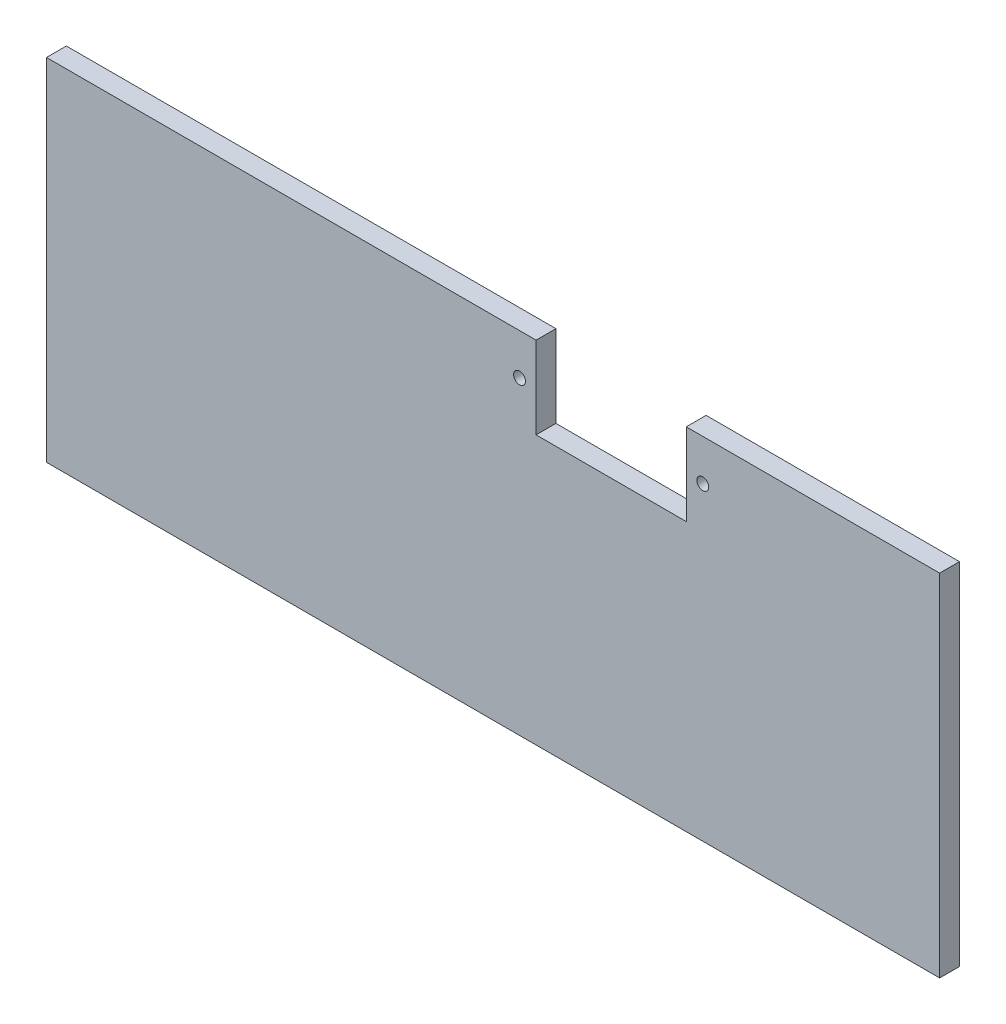
ISO-10303-21;
HEADER;
FILE_DESCRIPTION(('STEP AP214'),'2;1');
FILE_NAME('part.step','',(''),(''),'','','');
FILE_SCHEMA(('AUTOMOTIVE_DESIGN { 1 0 10303 214 1 1 1 1 }'));
ENDSEC;
DATA;
#1=APPLICATION_CONTEXT('core data for automotive mechanical design processes');
#2=APPLICATION_PROTOCOL_DEFINITION('international standard','automotive_design',2000,#1);
#3=PRODUCT_CONTEXT('',#1,'mechanical');
#4=PRODUCT('Part','Part','',(#3));
#5=PRODUCT_RELATED_PRODUCT_CATEGORY('part','',(#4));
#6=PRODUCT_DEFINITION_FORMATION('','',#4);
#7=PRODUCT_DEFINITION_CONTEXT('part definition',#1,'design');
#8=PRODUCT_DEFINITION('design','',#6,#7);
#9=PRODUCT_DEFINITION_SHAPE('','',#8);
#10=(LENGTH_UNIT() NAMED_UNIT(*) SI_UNIT(.MILLI.,.METRE.));
#11=(NAMED_UNIT(*) PLANE_ANGLE_UNIT() SI_UNIT($,.RADIAN.));
#12=(NAMED_UNIT(*) SI_UNIT($,.STERADIAN.) SOLID_ANGLE_UNIT());
#13=UNCERTAINTY_MEASURE_WITH_UNIT(LENGTH_MEASURE(1.E-05),#10,'distance_accuracy_value','');
#14=(GEOMETRIC_REPRESENTATION_CONTEXT(3) GLOBAL_UNCERTAINTY_ASSIGNED_CONTEXT((#13)) GLOBAL_UNIT_ASSIGNED_CONTEXT((#10,
#11,#12)) REPRESENTATION_CONTEXT('',''));
#15=CARTESIAN_POINT('',(0.,0.,0.));
#16=DIRECTION('',(0.,0.,1.));
#17=DIRECTION('',(1.,0.,0.));
#18=AXIS2_PLACEMENT_3D('',#15,#16,#17);
#19=CARTESIAN_POINT('',(-85.35,12.4,3.));
#20=DIRECTION('',(0.,-1.,0.));
#21=DIRECTION('',(0.,0.,-1.));
#22=AXIS2_PLACEMENT_3D('',#19,#20,#21);
#23=PLANE('',#22);
#24=DIRECTION('',(0.,0.,-1.));
#25=VECTOR('',#24,1.);
#26=CARTESIAN_POINT('',(11.35,12.4,0.));
#27=LINE('',#26,#25);
#28=CARTESIAN_POINT('',(11.35,12.4,3.));
#29=VERTEX_POINT('',#28);
#30=CARTESIAN_POINT('',(11.35,12.4,0.));
#31=VERTEX_POINT('',#30);
#32=EDGE_CURVE('E114',#29,#31,#27,.T.);
#33=ORIENTED_EDGE('',*,*,#32,.F.);
#34=DIRECTION('',(-1.,0.,0.));
#35=VECTOR('',#34,1.);
#36=CARTESIAN_POINT('',(-85.35,12.4,3.));
#37=LINE('',#36,#35);
#38=CARTESIAN_POINT('',(49.65,12.4,3.));
#39=VERTEX_POINT('',#38);
#40=EDGE_CURVE('E148',#39,#29,#37,.T.);
#41=ORIENTED_EDGE('',*,*,#40,.F.);
#42=DIRECTION('',(0.,0.,-1.));
#43=VECTOR('',#42,1.);
#44=CARTESIAN_POINT('',(49.65,12.4,3.));
#45=LINE('',#44,#43);
#46=CARTESIAN_POINT('',(49.65,12.4,0.));
#47=VERTEX_POINT('',#46);
#48=EDGE_CURVE('E117',#39,#47,#45,.T.);
#49=ORIENTED_EDGE('',*,*,#48,.T.);
#50=DIRECTION('',(-1.,0.,0.));
#51=VECTOR('',#50,1.);
#52=CARTESIAN_POINT('',(-85.35,12.4,0.));
#53=LINE('',#52,#51);
#54=EDGE_CURVE('E112',#47,#31,#53,.T.);
#55=ORIENTED_EDGE('',*,*,#54,.T.);
#56=EDGE_LOOP('',(#33,#41,#49,#55));
#57=FACE_BOUND('',#56,.T.);
#58=ADVANCED_FACE('F34',(#57),#23,.F.);
#59=DIRECTION('',(0.,0.,1.));
#60=VECTOR('',#59,1.);
#61=CARTESIAN_POINT('',(-11.35,12.4,0.));
#62=LINE('',#61,#60);
#63=CARTESIAN_POINT('',(-11.35,12.4,0.));
#64=VERTEX_POINT('',#63);
#65=CARTESIAN_POINT('',(-11.35,12.4,3.));
#66=VERTEX_POINT('',#65);
#67=EDGE_CURVE('E125',#64,#66,#62,.T.);
#68=ORIENTED_EDGE('',*,*,#67,.F.);
#69=CARTESIAN_POINT('',(-85.35,12.4,0.));
#70=VERTEX_POINT('',#69);
#71=EDGE_CURVE('E80',#64,#70,#53,.T.);
#72=ORIENTED_EDGE('',*,*,#71,.T.);
#73=DIRECTION('',(0.,0.,-1.));
#74=VECTOR('',#73,1.);
#75=CARTESIAN_POINT('',(-85.35,12.4,3.));
#76=LINE('',#75,#74);
#77=CARTESIAN_POINT('',(-85.35,12.4,3.));
#78=VERTEX_POINT('',#77);
#79=EDGE_CURVE('E150',#78,#70,#76,.T.);
#80=ORIENTED_EDGE('',*,*,#79,.F.);
#81=EDGE_CURVE('E58',#66,#78,#37,.T.);
#82=ORIENTED_EDGE('',*,*,#81,.F.);
#83=EDGE_LOOP('',(#68,#72,#80,#82));
#84=FACE_BOUND('',#83,.T.);
#85=ADVANCED_FACE('F213',(#84),#23,.F.);
#86=CARTESIAN_POINT('',(0.,0.,3.));
#87=DIRECTION('',(0.,0.,1.));
#88=DIRECTION('',(1.,0.,0.));
#89=AXIS2_PLACEMENT_3D('',#86,#87,#88);
#90=PLANE('',#89);
#91=CARTESIAN_POINT('',(13.85,6.2,3.));
#92=DIRECTION('',(0.,0.,-1.));
#93=DIRECTION('',(-1.,0.,0.));
#94=AXIS2_PLACEMENT_3D('',#91,#92,#93);
#95=CIRCLE('',#94,0.9);
#96=CARTESIAN_POINT('',(12.95,6.2,3.));
#97=VERTEX_POINT('',#96);
#98=EDGE_CURVE('E183',#97,#97,#95,.T.);
#99=ORIENTED_EDGE('',*,*,#98,.T.);
#100=EDGE_LOOP('',(#99));
#101=FACE_BOUND('',#100,.T.);
#102=CARTESIAN_POINT('',(-13.85,6.2,3.));
#103=DIRECTION('',(0.,0.,-1.));
#104=DIRECTION('',(-1.,0.,0.));
#105=AXIS2_PLACEMENT_3D('',#102,#103,#104);
#106=CIRCLE('',#105,0.9);
#107=CARTESIAN_POINT('',(-14.75,6.2,3.));
#108=VERTEX_POINT('',#107);
#109=EDGE_CURVE('E174',#108,#108,#106,.T.);
#110=ORIENTED_EDGE('',*,*,#109,.T.);
#111=EDGE_LOOP('',(#110));
#112=FACE_BOUND('',#111,.T.);
#113=ORIENTED_EDGE('',*,*,#40,.T.);
#114=DIRECTION('',(0.,-1.,0.));
#115=VECTOR('',#114,1.);
#116=CARTESIAN_POINT('',(11.35,0.,3.));
#117=LINE('',#116,#115);
#118=CARTESIAN_POINT('',(11.35,0.,3.));
#119=VERTEX_POINT('',#118);
#120=EDGE_CURVE('E124',#29,#119,#117,.T.);
#121=ORIENTED_EDGE('',*,*,#120,.T.);
#122=DIRECTION('',(-1.,0.,0.));
#123=VECTOR('',#122,1.);
#124=CARTESIAN_POINT('',(0.,0.,3.));
#125=LINE('',#124,#123);
#126=CARTESIAN_POINT('',(-11.35,0.,3.));
#127=VERTEX_POINT('',#126);
#128=EDGE_CURVE('E132',#119,#127,#125,.T.);
#129=ORIENTED_EDGE('',*,*,#128,.T.);
#130=DIRECTION('',(0.,1.,0.));
#131=VECTOR('',#130,1.);
#132=CARTESIAN_POINT('',(-11.35,0.,3.));
#133=LINE('',#132,#131);
#134=EDGE_CURVE('E136',#127,#66,#133,.T.);
#135=ORIENTED_EDGE('',*,*,#134,.T.);
#136=ORIENTED_EDGE('',*,*,#81,.T.);
#137=DIRECTION('',(0.,-1.,0.));
#138=VECTOR('',#137,1.);
#139=CARTESIAN_POINT('',(-85.35,12.4,3.));
#140=LINE('',#139,#138);
#141=CARTESIAN_POINT('',(-85.35,-40.6,3.));
#142=VERTEX_POINT('',#141);
#143=EDGE_CURVE('E120',#78,#142,#140,.T.);
#144=ORIENTED_EDGE('',*,*,#143,.T.);
#145=DIRECTION('',(1.,0.,0.));
#146=VECTOR('',#145,1.);
#147=CARTESIAN_POINT('',(-85.35,-40.6,3.));
#148=LINE('',#147,#146);
#149=CARTESIAN_POINT('',(49.65,-40.6,3.));
#150=VERTEX_POINT('',#149);
#151=EDGE_CURVE('E88',#142,#150,#148,.T.);
#152=ORIENTED_EDGE('',*,*,#151,.T.);
#153=DIRECTION('',(0.,1.,0.));
#154=VECTOR('',#153,1.);
#155=CARTESIAN_POINT('',(49.65,12.4,3.));
#156=LINE('',#155,#154);
#157=EDGE_CURVE('E146',#150,#39,#156,.T.);
#158=ORIENTED_EDGE('',*,*,#157,.T.);
#159=EDGE_LOOP('',(#113,#121,#129,#135,#136,#144,#152,#158));
#160=FACE_BOUND('',#159,.T.);
#161=ADVANCED_FACE('F168',(#101,#112,#160),#90,.T.);
#162=CARTESIAN_POINT('',(0.,0.,0.));
#163=DIRECTION('',(0.,0.,1.));
#164=DIRECTION('',(1.,0.,0.));
#165=AXIS2_PLACEMENT_3D('',#162,#163,#164);
#166=PLANE('',#165);
#167=CARTESIAN_POINT('',(13.85,6.2,0.));
#168=DIRECTION('',(0.,0.,-1.));
#169=DIRECTION('',(-1.,0.,0.));
#170=AXIS2_PLACEMENT_3D('',#167,#168,#169);
#171=CIRCLE('',#170,0.9);
#172=CARTESIAN_POINT('',(12.95,6.2,0.));
#173=VERTEX_POINT('',#172);
#174=EDGE_CURVE('E186',#173,#173,#171,.T.);
#175=ORIENTED_EDGE('',*,*,#174,.F.);
#176=EDGE_LOOP('',(#175));
#177=FACE_BOUND('',#176,.T.);
#178=CARTESIAN_POINT('',(-13.85,6.2,0.));
#179=DIRECTION('',(0.,0.,-1.));
#180=DIRECTION('',(-1.,0.,0.));
#181=AXIS2_PLACEMENT_3D('',#178,#179,#180);
#182=CIRCLE('',#181,0.9);
#183=CARTESIAN_POINT('',(-14.75,6.2,0.));
#184=VERTEX_POINT('',#183);
#185=EDGE_CURVE('E177',#184,#184,#182,.T.);
#186=ORIENTED_EDGE('',*,*,#185,.F.);
#187=EDGE_LOOP('',(#186));
#188=FACE_BOUND('',#187,.T.);
#189=DIRECTION('',(0.,-1.,0.));
#190=VECTOR('',#189,1.);
#191=CARTESIAN_POINT('',(-85.35,12.4,0.));
#192=LINE('',#191,#190);
#193=CARTESIAN_POINT('',(-85.35,-40.6,0.));
#194=VERTEX_POINT('',#193);
#195=EDGE_CURVE('E143',#70,#194,#192,.T.);
#196=ORIENTED_EDGE('',*,*,#195,.F.);
#197=ORIENTED_EDGE('',*,*,#71,.F.);
#198=DIRECTION('',(0.,-1.,0.));
#199=VECTOR('',#198,1.);
#200=CARTESIAN_POINT('',(-11.35,12.4,0.));
#201=LINE('',#200,#199);
#202=CARTESIAN_POINT('',(-11.35,0.,0.));
#203=VERTEX_POINT('',#202);
#204=EDGE_CURVE('E133',#64,#203,#201,.T.);
#205=ORIENTED_EDGE('',*,*,#204,.T.);
#206=DIRECTION('',(-1.,0.,0.));
#207=VECTOR('',#206,1.);
#208=CARTESIAN_POINT('',(0.,0.,0.));
#209=LINE('',#208,#207);
#210=CARTESIAN_POINT('',(11.35,0.,0.));
#211=VERTEX_POINT('',#210);
#212=EDGE_CURVE('E11',#211,#203,#209,.T.);
#213=ORIENTED_EDGE('',*,*,#212,.F.);
#214=DIRECTION('',(0.,-1.,0.));
#215=VECTOR('',#214,1.);
#216=CARTESIAN_POINT('',(11.35,12.4,0.));
#217=LINE('',#216,#215);
#218=EDGE_CURVE('E49',#31,#211,#217,.T.);
#219=ORIENTED_EDGE('',*,*,#218,.F.);
#220=ORIENTED_EDGE('',*,*,#54,.F.);
#221=DIRECTION('',(0.,1.,0.));
#222=VECTOR('',#221,1.);
#223=CARTESIAN_POINT('',(49.65,12.4,0.));
#224=LINE('',#223,#222);
#225=CARTESIAN_POINT('',(49.65,-40.6,0.));
#226=VERTEX_POINT('',#225);
#227=EDGE_CURVE('E155',#226,#47,#224,.T.);
#228=ORIENTED_EDGE('',*,*,#227,.F.);
#229=DIRECTION('',(1.,0.,0.));
#230=VECTOR('',#229,1.);
#231=CARTESIAN_POINT('',(-85.35,-40.6,0.));
#232=LINE('',#231,#230);
#233=EDGE_CURVE('E153',#194,#226,#232,.T.);
#234=ORIENTED_EDGE('',*,*,#233,.F.);
#235=EDGE_LOOP('',(#196,#197,#205,#213,#219,#220,#228,#234));
#236=FACE_BOUND('',#235,.T.);
#237=ADVANCED_FACE('F130',(#177,#188,#236),#166,.F.);
#238=CARTESIAN_POINT('',(-85.35,12.4,3.));
#239=DIRECTION('',(1.,0.,0.));
#240=DIRECTION('',(0.,1.,0.));
#241=AXIS2_PLACEMENT_3D('',#238,#239,#240);
#242=PLANE('',#241);
#243=ORIENTED_EDGE('',*,*,#195,.T.);
#244=DIRECTION('',(0.,0.,-1.));
#245=VECTOR('',#244,1.);
#246=CARTESIAN_POINT('',(-85.35,-40.6,3.));
#247=LINE('',#246,#245);
#248=EDGE_CURVE('E42',#142,#194,#247,.T.);
#249=ORIENTED_EDGE('',*,*,#248,.F.);
#250=ORIENTED_EDGE('',*,*,#143,.F.);
#251=ORIENTED_EDGE('',*,*,#79,.T.);
#252=EDGE_LOOP('',(#243,#249,#250,#251));
#253=FACE_BOUND('',#252,.T.);
#254=ADVANCED_FACE('F36',(#253),#242,.F.);
#255=CARTESIAN_POINT('',(-85.35,-40.6,3.));
#256=DIRECTION('',(0.,1.,0.));
#257=DIRECTION('',(0.,0.,1.));
#258=AXIS2_PLACEMENT_3D('',#255,#256,#257);
#259=PLANE('',#258);
#260=ORIENTED_EDGE('',*,*,#233,.T.);
#261=DIRECTION('',(0.,0.,-1.));
#262=VECTOR('',#261,1.);
#263=CARTESIAN_POINT('',(49.65,-40.6,3.));
#264=LINE('',#263,#262);
#265=EDGE_CURVE('E159',#150,#226,#264,.T.);
#266=ORIENTED_EDGE('',*,*,#265,.F.);
#267=ORIENTED_EDGE('',*,*,#151,.F.);
#268=ORIENTED_EDGE('',*,*,#248,.T.);
#269=EDGE_LOOP('',(#260,#266,#267,#268));
#270=FACE_BOUND('',#269,.T.);
#271=ADVANCED_FACE('F162',(#270),#259,.F.);
#272=CARTESIAN_POINT('',(49.65,12.4,3.));
#273=DIRECTION('',(-1.,0.,0.));
#274=DIRECTION('',(0.,-1.,0.));
#275=AXIS2_PLACEMENT_3D('',#272,#273,#274);
#276=PLANE('',#275);
#277=ORIENTED_EDGE('',*,*,#227,.T.);
#278=ORIENTED_EDGE('',*,*,#48,.F.);
#279=ORIENTED_EDGE('',*,*,#157,.F.);
#280=ORIENTED_EDGE('',*,*,#265,.T.);
#281=EDGE_LOOP('',(#277,#278,#279,#280));
#282=FACE_BOUND('',#281,.T.);
#283=ADVANCED_FACE('F166',(#282),#276,.F.);
#284=CARTESIAN_POINT('',(0.,0.,5.00000000000001));
#285=DIRECTION('',(0.,1.,0.));
#286=DIRECTION('',(0.,0.,1.));
#287=AXIS2_PLACEMENT_3D('',#284,#285,#286);
#288=PLANE('',#287);
#289=DIRECTION('',(0.,0.,-1.));
#290=VECTOR('',#289,1.);
#291=CARTESIAN_POINT('',(11.35,0.,0.));
#292=LINE('',#291,#290);
#293=EDGE_CURVE('E172',#119,#211,#292,.T.);
#294=ORIENTED_EDGE('',*,*,#293,.T.);
#295=ORIENTED_EDGE('',*,*,#212,.T.);
#296=DIRECTION('',(0.,0.,1.));
#297=VECTOR('',#296,1.);
#298=CARTESIAN_POINT('',(-11.35,0.,0.));
#299=LINE('',#298,#297);
#300=EDGE_CURVE('E126',#203,#127,#299,.T.);
#301=ORIENTED_EDGE('',*,*,#300,.T.);
#302=ORIENTED_EDGE('',*,*,#128,.F.);
#303=EDGE_LOOP('',(#294,#295,#301,#302));
#304=FACE_BOUND('',#303,.T.);
#305=ADVANCED_FACE('F171',(#304),#288,.T.);
#306=CARTESIAN_POINT('',(11.35,12.4,0.));
#307=DIRECTION('',(-1.,0.,0.));
#308=DIRECTION('',(0.,0.,1.));
#309=AXIS2_PLACEMENT_3D('',#306,#307,#308);
#310=PLANE('',#309);
#311=ORIENTED_EDGE('',*,*,#32,.T.);
#312=ORIENTED_EDGE('',*,*,#218,.T.);
#313=ORIENTED_EDGE('',*,*,#293,.F.);
#314=ORIENTED_EDGE('',*,*,#120,.F.);
#315=EDGE_LOOP('',(#311,#312,#313,#314));
#316=FACE_BOUND('',#315,.T.);
#317=ADVANCED_FACE('F122',(#316),#310,.T.);
#318=CARTESIAN_POINT('',(-11.35,12.4,0.));
#319=DIRECTION('',(1.,0.,0.));
#320=DIRECTION('',(0.,0.,-1.));
#321=AXIS2_PLACEMENT_3D('',#318,#319,#320);
#322=PLANE('',#321);
#323=ORIENTED_EDGE('',*,*,#300,.F.);
#324=ORIENTED_EDGE('',*,*,#204,.F.);
#325=ORIENTED_EDGE('',*,*,#67,.T.);
#326=ORIENTED_EDGE('',*,*,#134,.F.);
#327=EDGE_LOOP('',(#323,#324,#325,#326));
#328=FACE_BOUND('',#327,.T.);
#329=ADVANCED_FACE('F199',(#328),#322,.T.);
#330=CARTESIAN_POINT('',(-13.85,6.2,0.));
#331=DIRECTION('',(0.,0.,-1.));
#332=DIRECTION('',(-1.,0.,0.));
#333=AXIS2_PLACEMENT_3D('',#330,#331,#332);
#334=CYLINDRICAL_SURFACE('',#333,0.9);
#335=ORIENTED_EDGE('',*,*,#109,.F.);
#336=EDGE_LOOP('',(#335));
#337=FACE_BOUND('',#336,.T.);
#338=ORIENTED_EDGE('',*,*,#185,.T.);
#339=EDGE_LOOP('',(#338));
#340=FACE_BOUND('',#339,.T.);
#341=ADVANCED_FACE('F197',(#337,#340),#334,.F.);
#342=CARTESIAN_POINT('',(13.85,6.2,0.));
#343=DIRECTION('',(0.,0.,-1.));
#344=DIRECTION('',(-1.,0.,0.));
#345=AXIS2_PLACEMENT_3D('',#342,#343,#344);
#346=CYLINDRICAL_SURFACE('',#345,0.9);
#347=ORIENTED_EDGE('',*,*,#98,.F.);
#348=EDGE_LOOP('',(#347));
#349=FACE_BOUND('',#348,.T.);
#350=ORIENTED_EDGE('',*,*,#174,.T.);
#351=EDGE_LOOP('',(#350));
#352=FACE_BOUND('',#351,.T.);
#353=ADVANCED_FACE('F190',(#349,#352),#346,.F.);
#354=CLOSED_SHELL('',(#58,#85,#161,#237,#254,#271,#283,#305,#317,#329,#341,#353));
#355=MANIFOLD_SOLID_BREP('B2',#354);
#356=ADVANCED_BREP_SHAPE_REPRESENTATION('',(#18,#355),#14);
#357=SHAPE_DEFINITION_REPRESENTATION(#9,#356);
ENDSEC;
END-ISO-10303-21;
